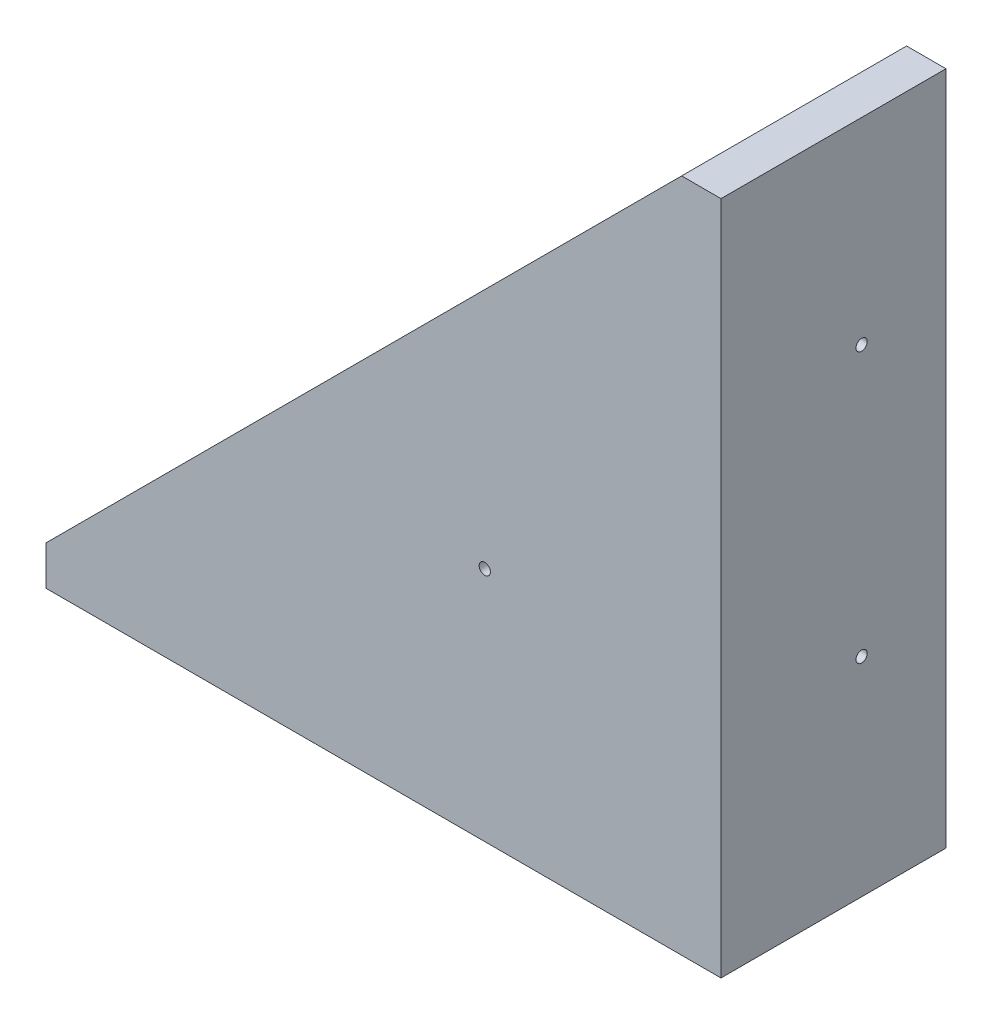
ISO-10303-21;
HEADER;
FILE_DESCRIPTION(('STEP AP214'),'2;1');
FILE_NAME('part.step','',(''),(''),'','','');
FILE_SCHEMA(('AUTOMOTIVE_DESIGN { 1 0 10303 214 1 1 1 1 }'));
ENDSEC;
DATA;
#1=APPLICATION_CONTEXT('core data for automotive mechanical design processes');
#2=APPLICATION_PROTOCOL_DEFINITION('international standard','automotive_design',2000,#1);
#3=PRODUCT_CONTEXT('',#1,'mechanical');
#4=PRODUCT('Part','Part','',(#3));
#5=PRODUCT_RELATED_PRODUCT_CATEGORY('part','',(#4));
#6=PRODUCT_DEFINITION_FORMATION('','',#4);
#7=PRODUCT_DEFINITION_CONTEXT('part definition',#1,'design');
#8=PRODUCT_DEFINITION('design','',#6,#7);
#9=PRODUCT_DEFINITION_SHAPE('','',#8);
#10=(LENGTH_UNIT() NAMED_UNIT(*) SI_UNIT(.MILLI.,.METRE.));
#11=(NAMED_UNIT(*) PLANE_ANGLE_UNIT() SI_UNIT($,.RADIAN.));
#12=(NAMED_UNIT(*) SI_UNIT($,.STERADIAN.) SOLID_ANGLE_UNIT());
#13=UNCERTAINTY_MEASURE_WITH_UNIT(LENGTH_MEASURE(1.E-05),#10,'distance_accuracy_value','');
#14=(GEOMETRIC_REPRESENTATION_CONTEXT(3) GLOBAL_UNCERTAINTY_ASSIGNED_CONTEXT((#13)) GLOBAL_UNIT_ASSIGNED_CONTEXT((#10,
#11,#12)) REPRESENTATION_CONTEXT('',''));
#15=CARTESIAN_POINT('',(0.,0.,0.));
#16=DIRECTION('',(0.,0.,1.));
#17=DIRECTION('',(1.,0.,0.));
#18=AXIS2_PLACEMENT_3D('',#15,#16,#17);
#19=CARTESIAN_POINT('',(20.2575159802783,0.,40.));
#20=DIRECTION('',(-1.,0.,0.));
#21=DIRECTION('',(0.,0.,1.));
#22=AXIS2_PLACEMENT_3D('',#19,#20,#21);
#23=PLANE('',#22);
#24=CARTESIAN_POINT('',(20.2575159802783,33.3366754681333,15.));
#25=DIRECTION('',(-1.,0.,0.));
#26=DIRECTION('',(0.,0.,1.));
#27=AXIS2_PLACEMENT_3D('',#24,#25,#26);
#28=CIRCLE('',#27,1.);
#29=CARTESIAN_POINT('',(20.2575159802783,33.3366754681333,16.));
#30=VERTEX_POINT('',#29);
#31=EDGE_CURVE('E167',#30,#30,#28,.T.);
#32=ORIENTED_EDGE('',*,*,#31,.F.);
#33=EDGE_LOOP('',(#32));
#34=FACE_BOUND('',#33,.T.);
#35=CARTESIAN_POINT('',(20.2575159802783,81.3366754681333,15.));
#36=DIRECTION('',(-1.,0.,0.));
#37=DIRECTION('',(0.,0.,1.));
#38=AXIS2_PLACEMENT_3D('',#35,#36,#37);
#39=CIRCLE('',#38,1.);
#40=CARTESIAN_POINT('',(20.2575159802783,81.3366754681333,16.));
#41=VERTEX_POINT('',#40);
#42=EDGE_CURVE('E157',#41,#41,#39,.T.);
#43=ORIENTED_EDGE('',*,*,#42,.F.);
#44=EDGE_LOOP('',(#43));
#45=FACE_BOUND('',#44,.T.);
#46=DIRECTION('',(0.,0.,-1.));
#47=VECTOR('',#46,1.);
#48=CARTESIAN_POINT('',(20.2575159802783,3.3366754681333,40.));
#49=LINE('',#48,#47);
#50=CARTESIAN_POINT('',(20.2575159802783,3.3366754681333,30.));
#51=VERTEX_POINT('',#50);
#52=CARTESIAN_POINT('',(20.2575159802783,3.3366754681333,0.));
#53=VERTEX_POINT('',#52);
#54=EDGE_CURVE('E42',#51,#53,#49,.T.);
#55=ORIENTED_EDGE('',*,*,#54,.F.);
#56=DIRECTION('',(0.,-1.,0.));
#57=VECTOR('',#56,1.);
#58=CARTESIAN_POINT('',(20.2575159802783,118.336675468133,30.));
#59=LINE('',#58,#57);
#60=CARTESIAN_POINT('',(20.2575159802783,116.336675468133,30.));
#61=VERTEX_POINT('',#60);
#62=EDGE_CURVE('E121',#61,#51,#59,.T.);
#63=ORIENTED_EDGE('',*,*,#62,.F.);
#64=DIRECTION('',(0.,0.,-1.));
#65=VECTOR('',#64,1.);
#66=CARTESIAN_POINT('',(20.2575159802783,116.336675468133,40.));
#67=LINE('',#66,#65);
#68=CARTESIAN_POINT('',(20.2575159802783,116.336675468133,0.));
#69=VERTEX_POINT('',#68);
#70=EDGE_CURVE('E126',#61,#69,#67,.T.);
#71=ORIENTED_EDGE('',*,*,#70,.T.);
#72=DIRECTION('',(0.,1.,0.));
#73=VECTOR('',#72,1.);
#74=CARTESIAN_POINT('',(20.2575159802783,0.,0.));
#75=LINE('',#74,#73);
#76=EDGE_CURVE('E127',#53,#69,#75,.T.);
#77=ORIENTED_EDGE('',*,*,#76,.F.);
#78=EDGE_LOOP('',(#55,#63,#71,#77));
#79=FACE_BOUND('',#78,.T.);
#80=ADVANCED_FACE('F34',(#34,#45,#79),#23,.T.);
#81=CARTESIAN_POINT('',(0.,3.3366754681333,40.));
#82=DIRECTION('',(0.,1.,0.));
#83=DIRECTION('',(-1.,0.,0.));
#84=AXIS2_PLACEMENT_3D('',#81,#82,#83);
#85=PLANE('',#84);
#86=CARTESIAN_POINT('',(-9.74248401972168,3.3366754681333,15.));
#87=DIRECTION('',(0.,1.,0.));
#88=DIRECTION('',(-1.,0.,0.));
#89=AXIS2_PLACEMENT_3D('',#86,#87,#88);
#90=CIRCLE('',#89,1.);
#91=CARTESIAN_POINT('',(-10.7424840197217,3.3366754681333,15.));
#92=VERTEX_POINT('',#91);
#93=EDGE_CURVE('E154',#92,#92,#90,.T.);
#94=ORIENTED_EDGE('',*,*,#93,.F.);
#95=EDGE_LOOP('',(#94));
#96=FACE_BOUND('',#95,.T.);
#97=CARTESIAN_POINT('',(-57.7424840197217,3.33667546813329,15.));
#98=DIRECTION('',(0.,1.,0.));
#99=DIRECTION('',(-1.,0.,0.));
#100=AXIS2_PLACEMENT_3D('',#97,#98,#99);
#101=CIRCLE('',#100,0.999999999999998);
#102=CARTESIAN_POINT('',(-58.7424840197217,3.33667546813329,15.));
#103=VERTEX_POINT('',#102);
#104=EDGE_CURVE('E151',#103,#103,#101,.T.);
#105=ORIENTED_EDGE('',*,*,#104,.F.);
#106=EDGE_LOOP('',(#105));
#107=FACE_BOUND('',#106,.T.);
#108=DIRECTION('',(0.,0.,-1.));
#109=VECTOR('',#108,1.);
#110=CARTESIAN_POINT('',(-92.7424840197217,3.33667546813329,40.));
#111=LINE('',#110,#109);
#112=CARTESIAN_POINT('',(-92.7424840197217,3.33667546813329,30.));
#113=VERTEX_POINT('',#112);
#114=CARTESIAN_POINT('',(-92.7424840197217,3.33667546813329,0.));
#115=VERTEX_POINT('',#114);
#116=EDGE_CURVE('E146',#113,#115,#111,.T.);
#117=ORIENTED_EDGE('',*,*,#116,.F.);
#118=DIRECTION('',(-1.,0.,0.));
#119=VECTOR('',#118,1.);
#120=CARTESIAN_POINT('',(20.2575159802783,3.3366754681333,30.));
#121=LINE('',#120,#119);
#122=EDGE_CURVE('E50',#51,#113,#121,.T.);
#123=ORIENTED_EDGE('',*,*,#122,.F.);
#124=ORIENTED_EDGE('',*,*,#54,.T.);
#125=DIRECTION('',(1.,0.,0.));
#126=VECTOR('',#125,1.);
#127=CARTESIAN_POINT('',(0.,3.3366754681333,0.));
#128=LINE('',#127,#126);
#129=EDGE_CURVE('E130',#115,#53,#128,.T.);
#130=ORIENTED_EDGE('',*,*,#129,.F.);
#131=EDGE_LOOP('',(#117,#123,#124,#130));
#132=FACE_BOUND('',#131,.T.);
#133=ADVANCED_FACE('F189',(#96,#107,#132),#85,.T.);
#134=CARTESIAN_POINT('',(-92.7424840197217,0.,40.));
#135=DIRECTION('',(1.,0.,0.));
#136=DIRECTION('',(0.,0.,-1.));
#137=AXIS2_PLACEMENT_3D('',#134,#135,#136);
#138=PLANE('',#137);
#139=DIRECTION('',(0.,-1.,0.));
#140=VECTOR('',#139,1.);
#141=CARTESIAN_POINT('',(-92.7424840197217,0.,40.));
#142=LINE('',#141,#140);
#143=CARTESIAN_POINT('',(-92.7424840197217,3.33667546813329,40.));
#144=VERTEX_POINT('',#143);
#145=CARTESIAN_POINT('',(-92.7424840197217,-3.6633245318667,40.));
#146=VERTEX_POINT('',#145);
#147=EDGE_CURVE('E102',#144,#146,#142,.T.);
#148=ORIENTED_EDGE('',*,*,#147,.F.);
#149=DIRECTION('',(0.,0.,1.));
#150=VECTOR('',#149,1.);
#151=CARTESIAN_POINT('',(-92.7424840197217,3.33667546813329,-75.));
#152=LINE('',#151,#150);
#153=EDGE_CURVE('E92',#113,#144,#152,.T.);
#154=ORIENTED_EDGE('',*,*,#153,.F.);
#155=ORIENTED_EDGE('',*,*,#116,.T.);
#156=DIRECTION('',(0.,-1.,0.));
#157=VECTOR('',#156,1.);
#158=CARTESIAN_POINT('',(-92.7424840197217,0.,0.));
#159=LINE('',#158,#157);
#160=CARTESIAN_POINT('',(-92.7424840197217,-3.6633245318667,0.));
#161=VERTEX_POINT('',#160);
#162=EDGE_CURVE('E133',#115,#161,#159,.T.);
#163=ORIENTED_EDGE('',*,*,#162,.T.);
#164=DIRECTION('',(0.,0.,-1.));
#165=VECTOR('',#164,1.);
#166=CARTESIAN_POINT('',(-92.7424840197217,-3.6633245318667,40.));
#167=LINE('',#166,#165);
#168=EDGE_CURVE('E110',#146,#161,#167,.T.);
#169=ORIENTED_EDGE('',*,*,#168,.F.);
#170=EDGE_LOOP('',(#148,#154,#155,#163,#169));
#171=FACE_BOUND('',#170,.T.);
#172=ADVANCED_FACE('F108',(#171),#138,.F.);
#173=CARTESIAN_POINT('',(0.,-3.6633245318667,40.));
#174=DIRECTION('',(0.,1.,0.));
#175=DIRECTION('',(0.,0.,1.));
#176=AXIS2_PLACEMENT_3D('',#173,#174,#175);
#177=PLANE('',#176);
#178=CARTESIAN_POINT('',(-9.74248401972168,-3.6633245318667,15.));
#179=DIRECTION('',(0.,1.,0.));
#180=DIRECTION('',(0.,0.,1.));
#181=AXIS2_PLACEMENT_3D('',#178,#179,#180);
#182=CIRCLE('',#181,1.);
#183=CARTESIAN_POINT('',(-9.74248401972168,-3.6633245318667,16.));
#184=VERTEX_POINT('',#183);
#185=EDGE_CURVE('E152',#184,#184,#182,.T.);
#186=ORIENTED_EDGE('',*,*,#185,.T.);
#187=EDGE_LOOP('',(#186));
#188=FACE_BOUND('',#187,.T.);
#189=CARTESIAN_POINT('',(-57.7424840197217,-3.6633245318667,15.));
#190=DIRECTION('',(0.,1.,0.));
#191=DIRECTION('',(0.,0.,1.));
#192=AXIS2_PLACEMENT_3D('',#189,#190,#191);
#193=CIRCLE('',#192,0.999999999999998);
#194=CARTESIAN_POINT('',(-57.7424840197217,-3.6633245318667,16.));
#195=VERTEX_POINT('',#194);
#196=EDGE_CURVE('E106',#195,#195,#193,.T.);
#197=ORIENTED_EDGE('',*,*,#196,.T.);
#198=EDGE_LOOP('',(#197));
#199=FACE_BOUND('',#198,.T.);
#200=DIRECTION('',(1.,0.,0.));
#201=VECTOR('',#200,1.);
#202=CARTESIAN_POINT('',(0.,-3.6633245318667,0.));
#203=LINE('',#202,#201);
#204=CARTESIAN_POINT('',(27.2575159802783,-3.6633245318667,0.));
#205=VERTEX_POINT('',#204);
#206=EDGE_CURVE('E135',#161,#205,#203,.T.);
#207=ORIENTED_EDGE('',*,*,#206,.T.);
#208=DIRECTION('',(0.,0.,-1.));
#209=VECTOR('',#208,1.);
#210=CARTESIAN_POINT('',(27.2575159802783,-3.6633245318667,40.));
#211=LINE('',#210,#209);
#212=CARTESIAN_POINT('',(27.2575159802783,-3.6633245318667,40.));
#213=VERTEX_POINT('',#212);
#214=EDGE_CURVE('E142',#213,#205,#211,.T.);
#215=ORIENTED_EDGE('',*,*,#214,.F.);
#216=DIRECTION('',(1.,0.,0.));
#217=VECTOR('',#216,1.);
#218=CARTESIAN_POINT('',(0.,-3.6633245318667,40.));
#219=LINE('',#218,#217);
#220=EDGE_CURVE('E112',#146,#213,#219,.T.);
#221=ORIENTED_EDGE('',*,*,#220,.F.);
#222=ORIENTED_EDGE('',*,*,#168,.T.);
#223=EDGE_LOOP('',(#207,#215,#221,#222));
#224=FACE_BOUND('',#223,.T.);
#225=ADVANCED_FACE('F191',(#188,#199,#224),#177,.F.);
#226=CARTESIAN_POINT('',(27.2575159802783,0.,40.));
#227=DIRECTION('',(-1.,0.,0.));
#228=DIRECTION('',(0.,0.,1.));
#229=AXIS2_PLACEMENT_3D('',#226,#227,#228);
#230=PLANE('',#229);
#231=CARTESIAN_POINT('',(27.2575159802783,33.3366754681333,15.));
#232=DIRECTION('',(-1.,0.,0.));
#233=DIRECTION('',(0.,0.,1.));
#234=AXIS2_PLACEMENT_3D('',#231,#232,#233);
#235=CIRCLE('',#234,1.);
#236=CARTESIAN_POINT('',(27.2575159802783,33.3366754681333,16.));
#237=VERTEX_POINT('',#236);
#238=EDGE_CURVE('E37',#237,#237,#235,.T.);
#239=ORIENTED_EDGE('',*,*,#238,.T.);
#240=EDGE_LOOP('',(#239));
#241=FACE_BOUND('',#240,.T.);
#242=CARTESIAN_POINT('',(27.2575159802783,81.3366754681333,15.));
#243=DIRECTION('',(-1.,0.,0.));
#244=DIRECTION('',(0.,0.,1.));
#245=AXIS2_PLACEMENT_3D('',#242,#243,#244);
#246=CIRCLE('',#245,1.);
#247=CARTESIAN_POINT('',(27.2575159802783,81.3366754681333,16.));
#248=VERTEX_POINT('',#247);
#249=EDGE_CURVE('E155',#248,#248,#246,.T.);
#250=ORIENTED_EDGE('',*,*,#249,.T.);
#251=EDGE_LOOP('',(#250));
#252=FACE_BOUND('',#251,.T.);
#253=DIRECTION('',(0.,1.,0.));
#254=VECTOR('',#253,1.);
#255=CARTESIAN_POINT('',(27.2575159802783,0.,0.));
#256=LINE('',#255,#254);
#257=CARTESIAN_POINT('',(27.2575159802783,116.336675468133,0.));
#258=VERTEX_POINT('',#257);
#259=EDGE_CURVE('E118',#205,#258,#256,.T.);
#260=ORIENTED_EDGE('',*,*,#259,.T.);
#261=DIRECTION('',(0.,0.,-1.));
#262=VECTOR('',#261,1.);
#263=CARTESIAN_POINT('',(27.2575159802783,116.336675468133,40.));
#264=LINE('',#263,#262);
#265=CARTESIAN_POINT('',(27.2575159802783,116.336675468133,40.));
#266=VERTEX_POINT('',#265);
#267=EDGE_CURVE('E139',#266,#258,#264,.T.);
#268=ORIENTED_EDGE('',*,*,#267,.F.);
#269=DIRECTION('',(0.,1.,0.));
#270=VECTOR('',#269,1.);
#271=CARTESIAN_POINT('',(27.2575159802783,0.,40.));
#272=LINE('',#271,#270);
#273=EDGE_CURVE('E115',#213,#266,#272,.T.);
#274=ORIENTED_EDGE('',*,*,#273,.F.);
#275=ORIENTED_EDGE('',*,*,#214,.T.);
#276=EDGE_LOOP('',(#260,#268,#274,#275));
#277=FACE_BOUND('',#276,.T.);
#278=ADVANCED_FACE('F194',(#241,#252,#277),#230,.F.);
#279=CARTESIAN_POINT('',(0.,116.336675468133,40.));
#280=DIRECTION('',(0.,-1.,0.));
#281=DIRECTION('',(0.,0.,-1.));
#282=AXIS2_PLACEMENT_3D('',#279,#280,#281);
#283=PLANE('',#282);
#284=DIRECTION('',(-1.,0.,0.));
#285=VECTOR('',#284,1.);
#286=CARTESIAN_POINT('',(0.,116.336675468133,0.));
#287=LINE('',#286,#285);
#288=EDGE_CURVE('E113',#258,#69,#287,.T.);
#289=ORIENTED_EDGE('',*,*,#288,.T.);
#290=ORIENTED_EDGE('',*,*,#70,.F.);
#291=CARTESIAN_POINT('',(20.2575159802783,116.336675468133,40.));
#292=VERTEX_POINT('',#291);
#293=EDGE_CURVE('E58',#292,#61,#67,.T.);
#294=ORIENTED_EDGE('',*,*,#293,.F.);
#295=DIRECTION('',(-1.,0.,0.));
#296=VECTOR('',#295,1.);
#297=CARTESIAN_POINT('',(0.,116.336675468133,40.));
#298=LINE('',#297,#296);
#299=EDGE_CURVE('E105',#266,#292,#298,.T.);
#300=ORIENTED_EDGE('',*,*,#299,.F.);
#301=ORIENTED_EDGE('',*,*,#267,.T.);
#302=EDGE_LOOP('',(#289,#290,#294,#300,#301));
#303=FACE_BOUND('',#302,.T.);
#304=ADVANCED_FACE('F180',(#303),#283,.F.);
#305=CARTESIAN_POINT('',(0.,0.,40.));
#306=DIRECTION('',(0.,0.,1.));
#307=DIRECTION('',(1.,0.,0.));
#308=AXIS2_PLACEMENT_3D('',#305,#306,#307);
#309=PLANE('',#308);
#310=CARTESIAN_POINT('',(-14.7424840197217,38.3366754681333,40.));
#311=DIRECTION('',(0.,0.,1.));
#312=DIRECTION('',(1.,0.,0.));
#313=AXIS2_PLACEMENT_3D('',#310,#311,#312);
#314=CIRCLE('',#313,1.);
#315=CARTESIAN_POINT('',(-13.7424840197217,38.3366754681333,40.));
#316=VERTEX_POINT('',#315);
#317=EDGE_CURVE('E216',#316,#316,#314,.T.);
#318=ORIENTED_EDGE('',*,*,#317,.F.);
#319=EDGE_LOOP('',(#318));
#320=FACE_BOUND('',#319,.T.);
#321=DIRECTION('',(0.707106781186547,0.707106781186547,0.));
#322=VECTOR('',#321,1.);
#323=CARTESIAN_POINT('',(20.2575159802783,116.336675468133,40.));
#324=LINE('',#323,#322);
#325=EDGE_CURVE('E95',#144,#292,#324,.T.);
#326=ORIENTED_EDGE('',*,*,#325,.F.);
#327=ORIENTED_EDGE('',*,*,#147,.T.);
#328=ORIENTED_EDGE('',*,*,#220,.T.);
#329=ORIENTED_EDGE('',*,*,#273,.T.);
#330=ORIENTED_EDGE('',*,*,#299,.T.);
#331=EDGE_LOOP('',(#326,#327,#328,#329,#330));
#332=FACE_BOUND('',#331,.T.);
#333=ADVANCED_FACE('F101',(#320,#332),#309,.T.);
#334=CARTESIAN_POINT('',(0.,0.,0.));
#335=DIRECTION('',(0.,0.,1.));
#336=DIRECTION('',(1.,0.,0.));
#337=AXIS2_PLACEMENT_3D('',#334,#335,#336);
#338=PLANE('',#337);
#339=ORIENTED_EDGE('',*,*,#76,.T.);
#340=ORIENTED_EDGE('',*,*,#288,.F.);
#341=ORIENTED_EDGE('',*,*,#259,.F.);
#342=ORIENTED_EDGE('',*,*,#206,.F.);
#343=ORIENTED_EDGE('',*,*,#162,.F.);
#344=ORIENTED_EDGE('',*,*,#129,.T.);
#345=EDGE_LOOP('',(#339,#340,#341,#342,#343,#344));
#346=FACE_BOUND('',#345,.T.);
#347=ADVANCED_FACE('F185',(#346),#338,.F.);
#348=CARTESIAN_POINT('',(20.2575159802783,118.336675468133,30.));
#349=DIRECTION('',(0.,0.,1.));
#350=DIRECTION('',(1.,0.,0.));
#351=AXIS2_PLACEMENT_3D('',#348,#349,#350);
#352=PLANE('',#351);
#353=CARTESIAN_POINT('',(-14.7424840197217,38.3366754681333,30.));
#354=DIRECTION('',(0.,0.,-1.));
#355=DIRECTION('',(-1.,0.,0.));
#356=AXIS2_PLACEMENT_3D('',#353,#354,#355);
#357=CIRCLE('',#356,1.);
#358=CARTESIAN_POINT('',(-15.7424840197217,38.3366754681333,30.));
#359=VERTEX_POINT('',#358);
#360=EDGE_CURVE('E218',#359,#359,#357,.T.);
#361=ORIENTED_EDGE('',*,*,#360,.F.);
#362=EDGE_LOOP('',(#361));
#363=FACE_BOUND('',#362,.T.);
#364=ORIENTED_EDGE('',*,*,#122,.T.);
#365=DIRECTION('',(0.707106781186548,0.707106781186548,0.));
#366=VECTOR('',#365,1.);
#367=CARTESIAN_POINT('',(21.2575159802783,117.336675468133,30.));
#368=LINE('',#367,#366);
#369=EDGE_CURVE('E11',#113,#61,#368,.T.);
#370=ORIENTED_EDGE('',*,*,#369,.T.);
#371=ORIENTED_EDGE('',*,*,#62,.T.);
#372=EDGE_LOOP('',(#364,#370,#371));
#373=FACE_BOUND('',#372,.T.);
#374=ADVANCED_FACE('F175',(#363,#373),#352,.F.);
#375=CARTESIAN_POINT('',(20.2575159802783,116.336675468133,-75.));
#376=DIRECTION('',(0.707106781186548,-0.707106781186548,0.));
#377=DIRECTION('',(0.707106781186548,0.707106781186548,0.));
#378=AXIS2_PLACEMENT_3D('',#375,#376,#377);
#379=PLANE('',#378);
#380=ORIENTED_EDGE('',*,*,#153,.T.);
#381=ORIENTED_EDGE('',*,*,#325,.T.);
#382=ORIENTED_EDGE('',*,*,#293,.T.);
#383=ORIENTED_EDGE('',*,*,#369,.F.);
#384=EDGE_LOOP('',(#380,#381,#382,#383));
#385=FACE_BOUND('',#384,.T.);
#386=ADVANCED_FACE('F94',(#385),#379,.F.);
#387=CARTESIAN_POINT('',(-57.7424840197217,-111.663324531867,15.));
#388=DIRECTION('',(0.,1.,0.));
#389=DIRECTION('',(-1.,0.,0.));
#390=AXIS2_PLACEMENT_3D('',#387,#388,#389);
#391=CYLINDRICAL_SURFACE('',#390,0.999999999999998);
#392=ORIENTED_EDGE('',*,*,#104,.T.);
#393=EDGE_LOOP('',(#392));
#394=FACE_BOUND('',#393,.T.);
#395=ORIENTED_EDGE('',*,*,#196,.F.);
#396=EDGE_LOOP('',(#395));
#397=FACE_BOUND('',#396,.T.);
#398=ADVANCED_FACE('F234',(#394,#397),#391,.F.);
#399=CARTESIAN_POINT('',(-9.74248401972167,-111.663324531867,15.));
#400=DIRECTION('',(0.,1.,0.));
#401=DIRECTION('',(-1.,0.,0.));
#402=AXIS2_PLACEMENT_3D('',#399,#400,#401);
#403=CYLINDRICAL_SURFACE('',#402,1.);
#404=ORIENTED_EDGE('',*,*,#93,.T.);
#405=EDGE_LOOP('',(#404));
#406=FACE_BOUND('',#405,.T.);
#407=ORIENTED_EDGE('',*,*,#185,.F.);
#408=EDGE_LOOP('',(#407));
#409=FACE_BOUND('',#408,.T.);
#410=ADVANCED_FACE('F274',(#406,#409),#403,.F.);
#411=CARTESIAN_POINT('',(135.257515980278,81.3366754681333,15.));
#412=DIRECTION('',(-1.,0.,0.));
#413=DIRECTION('',(0.,0.,1.));
#414=AXIS2_PLACEMENT_3D('',#411,#412,#413);
#415=CYLINDRICAL_SURFACE('',#414,1.);
#416=ORIENTED_EDGE('',*,*,#42,.T.);
#417=EDGE_LOOP('',(#416));
#418=FACE_BOUND('',#417,.T.);
#419=ORIENTED_EDGE('',*,*,#249,.F.);
#420=EDGE_LOOP('',(#419));
#421=FACE_BOUND('',#420,.T.);
#422=ADVANCED_FACE('F250',(#418,#421),#415,.F.);
#423=CARTESIAN_POINT('',(135.257515980278,33.3366754681333,15.));
#424=DIRECTION('',(-1.,0.,0.));
#425=DIRECTION('',(0.,0.,1.));
#426=AXIS2_PLACEMENT_3D('',#423,#424,#425);
#427=CYLINDRICAL_SURFACE('',#426,1.);
#428=ORIENTED_EDGE('',*,*,#31,.T.);
#429=EDGE_LOOP('',(#428));
#430=FACE_BOUND('',#429,.T.);
#431=ORIENTED_EDGE('',*,*,#238,.F.);
#432=EDGE_LOOP('',(#431));
#433=FACE_BOUND('',#432,.T.);
#434=ADVANCED_FACE('F246',(#430,#433),#427,.F.);
#435=CARTESIAN_POINT('',(-14.7424840197217,38.3366754681333,50.));
#436=DIRECTION('',(0.,0.,-1.));
#437=DIRECTION('',(-1.,0.,0.));
#438=AXIS2_PLACEMENT_3D('',#435,#436,#437);
#439=CYLINDRICAL_SURFACE('',#438,1.);
#440=ORIENTED_EDGE('',*,*,#317,.T.);
#441=EDGE_LOOP('',(#440));
#442=FACE_BOUND('',#441,.T.);
#443=ORIENTED_EDGE('',*,*,#360,.T.);
#444=EDGE_LOOP('',(#443));
#445=FACE_BOUND('',#444,.T.);
#446=ADVANCED_FACE('F225',(#442,#445),#439,.F.);
#447=CLOSED_SHELL('',(#80,#133,#172,#225,#278,#304,#333,#347,#374,#386,#398,#410,#422,#434,#446));
#448=MANIFOLD_SOLID_BREP('B2',#447);
#449=ADVANCED_BREP_SHAPE_REPRESENTATION('',(#18,#448),#14);
#450=SHAPE_DEFINITION_REPRESENTATION(#9,#449);
ENDSEC;
END-ISO-10303-21;
